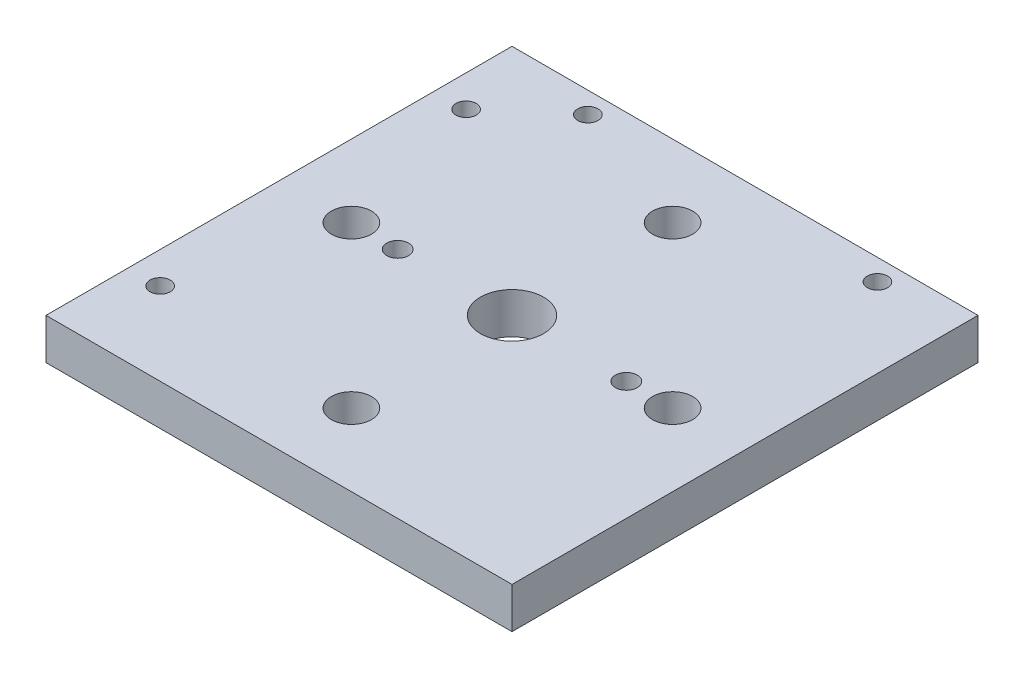
ISO-10303-21;
HEADER;
FILE_DESCRIPTION(('STEP AP214'),'2;1');
FILE_NAME('part.step','',(''),(''),'','','');
FILE_SCHEMA(('AUTOMOTIVE_DESIGN { 1 0 10303 214 1 1 1 1 }'));
ENDSEC;
DATA;
#1=APPLICATION_CONTEXT('core data for automotive mechanical design processes');
#2=APPLICATION_PROTOCOL_DEFINITION('international standard','automotive_design',2000,#1);
#3=PRODUCT_CONTEXT('',#1,'mechanical');
#4=PRODUCT('Part','Part','',(#3));
#5=PRODUCT_RELATED_PRODUCT_CATEGORY('part','',(#4));
#6=PRODUCT_DEFINITION_FORMATION('','',#4);
#7=PRODUCT_DEFINITION_CONTEXT('part definition',#1,'design');
#8=PRODUCT_DEFINITION('design','',#6,#7);
#9=PRODUCT_DEFINITION_SHAPE('','',#8);
#10=(LENGTH_UNIT() NAMED_UNIT(*) SI_UNIT(.MILLI.,.METRE.));
#11=(NAMED_UNIT(*) PLANE_ANGLE_UNIT() SI_UNIT($,.RADIAN.));
#12=(NAMED_UNIT(*) SI_UNIT($,.STERADIAN.) SOLID_ANGLE_UNIT());
#13=UNCERTAINTY_MEASURE_WITH_UNIT(LENGTH_MEASURE(1.E-05),#10,'distance_accuracy_value','');
#14=(GEOMETRIC_REPRESENTATION_CONTEXT(3) GLOBAL_UNCERTAINTY_ASSIGNED_CONTEXT((#13)) GLOBAL_UNIT_ASSIGNED_CONTEXT((#10,
#11,#12)) REPRESENTATION_CONTEXT('',''));
#15=CARTESIAN_POINT('',(0.,0.,0.));
#16=DIRECTION('',(0.,0.,1.));
#17=DIRECTION('',(1.,0.,0.));
#18=AXIS2_PLACEMENT_3D('',#15,#16,#17);
#19=CARTESIAN_POINT('',(0.,6.477,0.));
#20=DIRECTION('',(0.,1.,0.));
#21=DIRECTION('',(0.,0.,1.));
#22=AXIS2_PLACEMENT_3D('',#19,#20,#21);
#23=PLANE('',#22);
#24=CARTESIAN_POINT('',(-18.08,6.477,0.));
#25=DIRECTION('',(0.,1.,0.));
#26=DIRECTION('',(0.,0.,1.));
#27=AXIS2_PLACEMENT_3D('',#24,#25,#26);
#28=CIRCLE('',#27,1.7272);
#29=CARTESIAN_POINT('',(-18.08,6.477,1.7272));
#30=VERTEX_POINT('',#29);
#31=EDGE_CURVE('E178',#30,#30,#28,.T.);
#32=ORIENTED_EDGE('',*,*,#31,.F.);
#33=EDGE_LOOP('',(#32));
#34=FACE_BOUND('',#33,.T.);
#35=CARTESIAN_POINT('',(18.08,6.477,0.));
#36=DIRECTION('',(0.,1.,0.));
#37=DIRECTION('',(0.,0.,1.));
#38=AXIS2_PLACEMENT_3D('',#35,#36,#37);
#39=CIRCLE('',#38,1.7272);
#40=CARTESIAN_POINT('',(18.08,6.477,1.7272));
#41=VERTEX_POINT('',#40);
#42=EDGE_CURVE('E172',#41,#41,#39,.T.);
#43=ORIENTED_EDGE('',*,*,#42,.F.);
#44=EDGE_LOOP('',(#43));
#45=FACE_BOUND('',#44,.T.);
#46=CARTESIAN_POINT('',(-31.8572925499688,6.477,-24.5971855554866));
#47=DIRECTION('',(0.,1.,0.));
#48=DIRECTION('',(0.,0.,1.));
#49=AXIS2_PLACEMENT_3D('',#46,#47,#48);
#50=CIRCLE('',#49,1.60477692632348);
#51=CARTESIAN_POINT('',(-31.8572925499688,6.477,-22.9924086291631));
#52=VERTEX_POINT('',#51);
#53=EDGE_CURVE('E155',#52,#52,#50,.T.);
#54=ORIENTED_EDGE('',*,*,#53,.F.);
#55=EDGE_LOOP('',(#54));
#56=FACE_BOUND('',#55,.T.);
#57=CARTESIAN_POINT('',(24.3098998713532,6.477,-33.4851808397397));
#58=DIRECTION('',(0.,1.,0.));
#59=DIRECTION('',(0.,0.,1.));
#60=AXIS2_PLACEMENT_3D('',#57,#58,#59);
#61=CIRCLE('',#60,1.60477692632348);
#62=CARTESIAN_POINT('',(24.3098998713532,6.477,-31.8804039134163));
#63=VERTEX_POINT('',#62);
#64=EDGE_CURVE('E143',#63,#63,#61,.T.);
#65=ORIENTED_EDGE('',*,*,#64,.F.);
#66=EDGE_LOOP('',(#65));
#67=FACE_BOUND('',#66,.T.);
#68=CARTESIAN_POINT('',(-25.4,6.477,0.));
#69=DIRECTION('',(0.,1.,0.));
#70=DIRECTION('',(0.,0.,1.));
#71=AXIS2_PLACEMENT_3D('',#68,#69,#70);
#72=CIRCLE('',#71,3.17500000000026);
#73=CARTESIAN_POINT('',(-25.4,6.477,3.17500000000027));
#74=VERTEX_POINT('',#73);
#75=EDGE_CURVE('E131',#74,#74,#72,.T.);
#76=ORIENTED_EDGE('',*,*,#75,.F.);
#77=EDGE_LOOP('',(#76));
#78=FACE_BOUND('',#77,.T.);
#79=CARTESIAN_POINT('',(25.4,6.477,0.));
#80=DIRECTION('',(0.,1.,0.));
#81=DIRECTION('',(0.,0.,1.));
#82=AXIS2_PLACEMENT_3D('',#79,#80,#81);
#83=CIRCLE('',#82,3.17500000000009);
#84=CARTESIAN_POINT('',(25.4,6.477,3.17500000000008));
#85=VERTEX_POINT('',#84);
#86=EDGE_CURVE('E119',#85,#85,#83,.T.);
#87=ORIENTED_EDGE('',*,*,#86,.F.);
#88=EDGE_LOOP('',(#87));
#89=FACE_BOUND('',#88,.T.);
#90=DIRECTION('',(0.,0.,-1.));
#91=VECTOR('',#90,1.);
#92=CARTESIAN_POINT('',(36.85,6.477,-36.85));
#93=LINE('',#92,#91);
#94=CARTESIAN_POINT('',(36.85,6.477,36.85));
#95=VERTEX_POINT('',#94);
#96=CARTESIAN_POINT('',(36.85,6.477,-36.85));
#97=VERTEX_POINT('',#96);
#98=EDGE_CURVE('E89',#95,#97,#93,.T.);
#99=ORIENTED_EDGE('',*,*,#98,.T.);
#100=DIRECTION('',(-1.,0.,0.));
#101=VECTOR('',#100,1.);
#102=CARTESIAN_POINT('',(-36.85,6.477,-36.85));
#103=LINE('',#102,#101);
#104=CARTESIAN_POINT('',(-36.85,6.477,-36.85));
#105=VERTEX_POINT('',#104);
#106=EDGE_CURVE('E84',#97,#105,#103,.T.);
#107=ORIENTED_EDGE('',*,*,#106,.T.);
#108=DIRECTION('',(0.,0.,1.));
#109=VECTOR('',#108,1.);
#110=CARTESIAN_POINT('',(-36.85,6.477,-36.85));
#111=LINE('',#110,#109);
#112=CARTESIAN_POINT('',(-36.85,6.477,36.85));
#113=VERTEX_POINT('',#112);
#114=EDGE_CURVE('E87',#105,#113,#111,.T.);
#115=ORIENTED_EDGE('',*,*,#114,.T.);
#116=DIRECTION('',(1.,0.,0.));
#117=VECTOR('',#116,1.);
#118=CARTESIAN_POINT('',(-36.85,6.477,36.85));
#119=LINE('',#118,#117);
#120=EDGE_CURVE('E54',#113,#95,#119,.T.);
#121=ORIENTED_EDGE('',*,*,#120,.T.);
#122=EDGE_LOOP('',(#99,#107,#115,#121));
#123=FACE_BOUND('',#122,.T.);
#124=CARTESIAN_POINT('',(0.,6.477,-25.4));
#125=DIRECTION('',(0.,1.,0.));
#126=DIRECTION('',(0.,0.,1.));
#127=AXIS2_PLACEMENT_3D('',#124,#125,#126);
#128=CIRCLE('',#127,3.175);
#129=CARTESIAN_POINT('',(0.,6.477,-22.225));
#130=VERTEX_POINT('',#129);
#131=EDGE_CURVE('E104',#130,#130,#128,.T.);
#132=ORIENTED_EDGE('',*,*,#131,.F.);
#133=EDGE_LOOP('',(#132));
#134=FACE_BOUND('',#133,.T.);
#135=CARTESIAN_POINT('',(0.,6.477,25.4));
#136=DIRECTION('',(0.,1.,0.));
#137=DIRECTION('',(0.,0.,1.));
#138=AXIS2_PLACEMENT_3D('',#135,#136,#137);
#139=CIRCLE('',#138,3.17500000000017);
#140=CARTESIAN_POINT('',(0.,6.477,28.5750000000002));
#141=VERTEX_POINT('',#140);
#142=EDGE_CURVE('E125',#141,#141,#139,.T.);
#143=ORIENTED_EDGE('',*,*,#142,.F.);
#144=EDGE_LOOP('',(#143));
#145=FACE_BOUND('',#144,.T.);
#146=CARTESIAN_POINT('',(0.,6.477,0.));
#147=DIRECTION('',(0.,1.,0.));
#148=DIRECTION('',(0.,0.,1.));
#149=AXIS2_PLACEMENT_3D('',#146,#147,#148);
#150=CIRCLE('',#149,5.);
#151=CARTESIAN_POINT('',(0.,6.477,5.));
#152=VERTEX_POINT('',#151);
#153=EDGE_CURVE('E137',#152,#152,#150,.T.);
#154=ORIENTED_EDGE('',*,*,#153,.F.);
#155=EDGE_LOOP('',(#154));
#156=FACE_BOUND('',#155,.T.);
#157=CARTESIAN_POINT('',(-21.4879647183401,6.477,-33.4851808397397));
#158=DIRECTION('',(0.,1.,0.));
#159=DIRECTION('',(0.,0.,1.));
#160=AXIS2_PLACEMENT_3D('',#157,#158,#159);
#161=CIRCLE('',#160,1.60477692632348);
#162=CARTESIAN_POINT('',(-21.4879647183401,6.477,-31.8804039134163));
#163=VERTEX_POINT('',#162);
#164=EDGE_CURVE('E149',#163,#163,#161,.T.);
#165=ORIENTED_EDGE('',*,*,#164,.F.);
#166=EDGE_LOOP('',(#165));
#167=FACE_BOUND('',#166,.T.);
#168=CARTESIAN_POINT('',(-31.8572925499688,6.477,23.7930109921139));
#169=DIRECTION('',(0.,1.,0.));
#170=DIRECTION('',(0.,0.,1.));
#171=AXIS2_PLACEMENT_3D('',#168,#169,#170);
#172=CIRCLE('',#171,1.60477692632348);
#173=CARTESIAN_POINT('',(-31.8572925499688,6.477,25.3977879184374));
#174=VERTEX_POINT('',#173);
#175=EDGE_CURVE('E161',#174,#174,#172,.T.);
#176=ORIENTED_EDGE('',*,*,#175,.F.);
#177=EDGE_LOOP('',(#176));
#178=FACE_BOUND('',#177,.T.);
#179=ADVANCED_FACE('F37',(#34,#45,#56,#67,#78,#89,#123,#134,#145,#156,#167,#178),#23,.T.);
#180=CARTESIAN_POINT('',(0.,0.,0.));
#181=DIRECTION('',(0.,1.,0.));
#182=DIRECTION('',(0.,0.,1.));
#183=AXIS2_PLACEMENT_3D('',#180,#181,#182);
#184=PLANE('',#183);
#185=CARTESIAN_POINT('',(-18.08,0.,0.));
#186=DIRECTION('',(0.,1.,0.));
#187=DIRECTION('',(0.,0.,1.));
#188=AXIS2_PLACEMENT_3D('',#185,#186,#187);
#189=CIRCLE('',#188,1.7272);
#190=CARTESIAN_POINT('',(-18.08,0.,1.7272));
#191=VERTEX_POINT('',#190);
#192=EDGE_CURVE('E175',#191,#191,#189,.T.);
#193=ORIENTED_EDGE('',*,*,#192,.T.);
#194=EDGE_LOOP('',(#193));
#195=FACE_BOUND('',#194,.T.);
#196=CARTESIAN_POINT('',(18.08,0.,0.));
#197=DIRECTION('',(0.,1.,0.));
#198=DIRECTION('',(0.,0.,1.));
#199=AXIS2_PLACEMENT_3D('',#196,#197,#198);
#200=CIRCLE('',#199,1.7272);
#201=CARTESIAN_POINT('',(18.08,0.,1.7272));
#202=VERTEX_POINT('',#201);
#203=EDGE_CURVE('E167',#202,#202,#200,.T.);
#204=ORIENTED_EDGE('',*,*,#203,.T.);
#205=EDGE_LOOP('',(#204));
#206=FACE_BOUND('',#205,.T.);
#207=DIRECTION('',(0.,0.,-1.));
#208=VECTOR('',#207,1.);
#209=CARTESIAN_POINT('',(36.85,0.,-36.85));
#210=LINE('',#209,#208);
#211=CARTESIAN_POINT('',(36.85,0.,36.85));
#212=VERTEX_POINT('',#211);
#213=CARTESIAN_POINT('',(36.85,0.,-36.85));
#214=VERTEX_POINT('',#213);
#215=EDGE_CURVE('E101',#212,#214,#210,.T.);
#216=ORIENTED_EDGE('',*,*,#215,.F.);
#217=DIRECTION('',(1.,0.,0.));
#218=VECTOR('',#217,1.);
#219=CARTESIAN_POINT('',(-36.85,0.,36.85));
#220=LINE('',#219,#218);
#221=CARTESIAN_POINT('',(-36.85,0.,36.85));
#222=VERTEX_POINT('',#221);
#223=EDGE_CURVE('E77',#222,#212,#220,.T.);
#224=ORIENTED_EDGE('',*,*,#223,.F.);
#225=DIRECTION('',(0.,0.,1.));
#226=VECTOR('',#225,1.);
#227=CARTESIAN_POINT('',(-36.85,0.,-36.85));
#228=LINE('',#227,#226);
#229=CARTESIAN_POINT('',(-36.85,0.,-36.85));
#230=VERTEX_POINT('',#229);
#231=EDGE_CURVE('E71',#230,#222,#228,.T.);
#232=ORIENTED_EDGE('',*,*,#231,.F.);
#233=DIRECTION('',(-1.,0.,0.));
#234=VECTOR('',#233,1.);
#235=CARTESIAN_POINT('',(-36.85,0.,-36.85));
#236=LINE('',#235,#234);
#237=EDGE_CURVE('E93',#214,#230,#236,.T.);
#238=ORIENTED_EDGE('',*,*,#237,.F.);
#239=EDGE_LOOP('',(#216,#224,#232,#238));
#240=FACE_BOUND('',#239,.T.);
#241=CARTESIAN_POINT('',(0.,0.,-25.4));
#242=DIRECTION('',(0.,1.,0.));
#243=DIRECTION('',(0.,0.,1.));
#244=AXIS2_PLACEMENT_3D('',#241,#242,#243);
#245=CIRCLE('',#244,3.175);
#246=CARTESIAN_POINT('',(0.,0.,-22.225));
#247=VERTEX_POINT('',#246);
#248=EDGE_CURVE('E116',#247,#247,#245,.T.);
#249=ORIENTED_EDGE('',*,*,#248,.T.);
#250=EDGE_LOOP('',(#249));
#251=FACE_BOUND('',#250,.T.);
#252=CARTESIAN_POINT('',(25.4,0.,0.));
#253=DIRECTION('',(0.,1.,0.));
#254=DIRECTION('',(0.,0.,1.));
#255=AXIS2_PLACEMENT_3D('',#252,#253,#254);
#256=CIRCLE('',#255,3.17500000000009);
#257=CARTESIAN_POINT('',(25.4,0.,3.17500000000008));
#258=VERTEX_POINT('',#257);
#259=EDGE_CURVE('E122',#258,#258,#256,.T.);
#260=ORIENTED_EDGE('',*,*,#259,.T.);
#261=EDGE_LOOP('',(#260));
#262=FACE_BOUND('',#261,.T.);
#263=CARTESIAN_POINT('',(0.,0.,25.4));
#264=DIRECTION('',(0.,1.,0.));
#265=DIRECTION('',(0.,0.,1.));
#266=AXIS2_PLACEMENT_3D('',#263,#264,#265);
#267=CIRCLE('',#266,3.17500000000017);
#268=CARTESIAN_POINT('',(0.,0.,28.5750000000002));
#269=VERTEX_POINT('',#268);
#270=EDGE_CURVE('E128',#269,#269,#267,.T.);
#271=ORIENTED_EDGE('',*,*,#270,.T.);
#272=EDGE_LOOP('',(#271));
#273=FACE_BOUND('',#272,.T.);
#274=CARTESIAN_POINT('',(-25.4,0.,0.));
#275=DIRECTION('',(0.,1.,0.));
#276=DIRECTION('',(0.,0.,1.));
#277=AXIS2_PLACEMENT_3D('',#274,#275,#276);
#278=CIRCLE('',#277,3.17500000000026);
#279=CARTESIAN_POINT('',(-25.4,0.,3.17500000000027));
#280=VERTEX_POINT('',#279);
#281=EDGE_CURVE('E134',#280,#280,#278,.T.);
#282=ORIENTED_EDGE('',*,*,#281,.T.);
#283=EDGE_LOOP('',(#282));
#284=FACE_BOUND('',#283,.T.);
#285=CARTESIAN_POINT('',(0.,0.,0.));
#286=DIRECTION('',(0.,1.,0.));
#287=DIRECTION('',(0.,0.,1.));
#288=AXIS2_PLACEMENT_3D('',#285,#286,#287);
#289=CIRCLE('',#288,5.);
#290=CARTESIAN_POINT('',(0.,0.,5.));
#291=VERTEX_POINT('',#290);
#292=EDGE_CURVE('E140',#291,#291,#289,.T.);
#293=ORIENTED_EDGE('',*,*,#292,.T.);
#294=EDGE_LOOP('',(#293));
#295=FACE_BOUND('',#294,.T.);
#296=CARTESIAN_POINT('',(24.3098998713532,0.,-33.4851808397397));
#297=DIRECTION('',(0.,1.,0.));
#298=DIRECTION('',(0.,0.,1.));
#299=AXIS2_PLACEMENT_3D('',#296,#297,#298);
#300=CIRCLE('',#299,1.60477692632348);
#301=CARTESIAN_POINT('',(24.3098998713532,0.,-31.8804039134163));
#302=VERTEX_POINT('',#301);
#303=EDGE_CURVE('E146',#302,#302,#300,.T.);
#304=ORIENTED_EDGE('',*,*,#303,.T.);
#305=EDGE_LOOP('',(#304));
#306=FACE_BOUND('',#305,.T.);
#307=CARTESIAN_POINT('',(-21.4879647183401,0.,-33.4851808397397));
#308=DIRECTION('',(0.,1.,0.));
#309=DIRECTION('',(0.,0.,1.));
#310=AXIS2_PLACEMENT_3D('',#307,#308,#309);
#311=CIRCLE('',#310,1.60477692632348);
#312=CARTESIAN_POINT('',(-21.4879647183401,0.,-31.8804039134163));
#313=VERTEX_POINT('',#312);
#314=EDGE_CURVE('E152',#313,#313,#311,.T.);
#315=ORIENTED_EDGE('',*,*,#314,.T.);
#316=EDGE_LOOP('',(#315));
#317=FACE_BOUND('',#316,.T.);
#318=CARTESIAN_POINT('',(-31.8572925499688,0.,-24.5971855554866));
#319=DIRECTION('',(0.,1.,0.));
#320=DIRECTION('',(0.,0.,1.));
#321=AXIS2_PLACEMENT_3D('',#318,#319,#320);
#322=CIRCLE('',#321,1.60477692632348);
#323=CARTESIAN_POINT('',(-31.8572925499688,0.,-22.9924086291631));
#324=VERTEX_POINT('',#323);
#325=EDGE_CURVE('E158',#324,#324,#322,.T.);
#326=ORIENTED_EDGE('',*,*,#325,.T.);
#327=EDGE_LOOP('',(#326));
#328=FACE_BOUND('',#327,.T.);
#329=CARTESIAN_POINT('',(-31.8572925499688,0.,23.7930109921139));
#330=DIRECTION('',(0.,1.,0.));
#331=DIRECTION('',(0.,0.,1.));
#332=AXIS2_PLACEMENT_3D('',#329,#330,#331);
#333=CIRCLE('',#332,1.60477692632348);
#334=CARTESIAN_POINT('',(-31.8572925499688,0.,25.3977879184374));
#335=VERTEX_POINT('',#334);
#336=EDGE_CURVE('E164',#335,#335,#333,.T.);
#337=ORIENTED_EDGE('',*,*,#336,.T.);
#338=EDGE_LOOP('',(#337));
#339=FACE_BOUND('',#338,.T.);
#340=ADVANCED_FACE('F112',(#195,#206,#240,#251,#262,#273,#284,#295,#306,#317,#328,#339),#184,.F.);
#341=CARTESIAN_POINT('',(36.85,6.477,-36.85));
#342=DIRECTION('',(-1.,0.,0.));
#343=DIRECTION('',(0.,0.,1.));
#344=AXIS2_PLACEMENT_3D('',#341,#342,#343);
#345=PLANE('',#344);
#346=ORIENTED_EDGE('',*,*,#215,.T.);
#347=DIRECTION('',(0.,-1.,0.));
#348=VECTOR('',#347,1.);
#349=CARTESIAN_POINT('',(36.85,6.477,-36.85));
#350=LINE('',#349,#348);
#351=EDGE_CURVE('E11',#97,#214,#350,.T.);
#352=ORIENTED_EDGE('',*,*,#351,.F.);
#353=ORIENTED_EDGE('',*,*,#98,.F.);
#354=DIRECTION('',(0.,-1.,0.));
#355=VECTOR('',#354,1.);
#356=CARTESIAN_POINT('',(36.85,6.477,36.85));
#357=LINE('',#356,#355);
#358=EDGE_CURVE('E97',#95,#212,#357,.T.);
#359=ORIENTED_EDGE('',*,*,#358,.T.);
#360=EDGE_LOOP('',(#346,#352,#353,#359));
#361=FACE_BOUND('',#360,.T.);
#362=ADVANCED_FACE('F39',(#361),#345,.F.);
#363=CARTESIAN_POINT('',(-36.85,6.477,-36.85));
#364=DIRECTION('',(0.,0.,1.));
#365=DIRECTION('',(1.,0.,0.));
#366=AXIS2_PLACEMENT_3D('',#363,#364,#365);
#367=PLANE('',#366);
#368=ORIENTED_EDGE('',*,*,#237,.T.);
#369=DIRECTION('',(0.,-1.,0.));
#370=VECTOR('',#369,1.);
#371=CARTESIAN_POINT('',(-36.85,6.477,-36.85));
#372=LINE('',#371,#370);
#373=EDGE_CURVE('E46',#105,#230,#372,.T.);
#374=ORIENTED_EDGE('',*,*,#373,.F.);
#375=ORIENTED_EDGE('',*,*,#106,.F.);
#376=ORIENTED_EDGE('',*,*,#351,.T.);
#377=EDGE_LOOP('',(#368,#374,#375,#376));
#378=FACE_BOUND('',#377,.T.);
#379=ADVANCED_FACE('F92',(#378),#367,.F.);
#380=CARTESIAN_POINT('',(-36.85,6.477,-36.85));
#381=DIRECTION('',(1.,0.,0.));
#382=DIRECTION('',(0.,0.,-1.));
#383=AXIS2_PLACEMENT_3D('',#380,#381,#382);
#384=PLANE('',#383);
#385=ORIENTED_EDGE('',*,*,#231,.T.);
#386=DIRECTION('',(0.,-1.,0.));
#387=VECTOR('',#386,1.);
#388=CARTESIAN_POINT('',(-36.85,6.477,36.85));
#389=LINE('',#388,#387);
#390=EDGE_CURVE('E94',#113,#222,#389,.T.);
#391=ORIENTED_EDGE('',*,*,#390,.F.);
#392=ORIENTED_EDGE('',*,*,#114,.F.);
#393=ORIENTED_EDGE('',*,*,#373,.T.);
#394=EDGE_LOOP('',(#385,#391,#392,#393));
#395=FACE_BOUND('',#394,.T.);
#396=ADVANCED_FACE('F95',(#395),#384,.F.);
#397=CARTESIAN_POINT('',(-36.85,6.477,36.85));
#398=DIRECTION('',(0.,0.,-1.));
#399=DIRECTION('',(-1.,0.,0.));
#400=AXIS2_PLACEMENT_3D('',#397,#398,#399);
#401=PLANE('',#400);
#402=ORIENTED_EDGE('',*,*,#223,.T.);
#403=ORIENTED_EDGE('',*,*,#358,.F.);
#404=ORIENTED_EDGE('',*,*,#120,.F.);
#405=ORIENTED_EDGE('',*,*,#390,.T.);
#406=EDGE_LOOP('',(#402,#403,#404,#405));
#407=FACE_BOUND('',#406,.T.);
#408=ADVANCED_FACE('F109',(#407),#401,.F.);
#409=CARTESIAN_POINT('',(0.,6.477,-25.4));
#410=DIRECTION('',(0.,-1.,0.));
#411=DIRECTION('',(0.,0.,-1.));
#412=AXIS2_PLACEMENT_3D('',#409,#410,#411);
#413=CYLINDRICAL_SURFACE('',#412,3.175);
#414=ORIENTED_EDGE('',*,*,#131,.T.);
#415=EDGE_LOOP('',(#414));
#416=FACE_BOUND('',#415,.T.);
#417=ORIENTED_EDGE('',*,*,#248,.F.);
#418=EDGE_LOOP('',(#417));
#419=FACE_BOUND('',#418,.T.);
#420=ADVANCED_FACE('F201',(#416,#419),#413,.F.);
#421=CARTESIAN_POINT('',(25.4,6.477,0.));
#422=DIRECTION('',(0.,-1.,0.));
#423=DIRECTION('',(0.,0.,-1.));
#424=AXIS2_PLACEMENT_3D('',#421,#422,#423);
#425=CYLINDRICAL_SURFACE('',#424,3.17500000000009);
#426=ORIENTED_EDGE('',*,*,#86,.T.);
#427=EDGE_LOOP('',(#426));
#428=FACE_BOUND('',#427,.T.);
#429=ORIENTED_EDGE('',*,*,#259,.F.);
#430=EDGE_LOOP('',(#429));
#431=FACE_BOUND('',#430,.T.);
#432=ADVANCED_FACE('F197',(#428,#431),#425,.F.);
#433=CARTESIAN_POINT('',(0.,6.477,25.4));
#434=DIRECTION('',(0.,-1.,0.));
#435=DIRECTION('',(0.,0.,-1.));
#436=AXIS2_PLACEMENT_3D('',#433,#434,#435);
#437=CYLINDRICAL_SURFACE('',#436,3.17500000000017);
#438=ORIENTED_EDGE('',*,*,#142,.T.);
#439=EDGE_LOOP('',(#438));
#440=FACE_BOUND('',#439,.T.);
#441=ORIENTED_EDGE('',*,*,#270,.F.);
#442=EDGE_LOOP('',(#441));
#443=FACE_BOUND('',#442,.T.);
#444=ADVANCED_FACE('F200',(#440,#443),#437,.F.);
#445=CARTESIAN_POINT('',(-25.4,6.477,0.));
#446=DIRECTION('',(0.,-1.,0.));
#447=DIRECTION('',(0.,0.,-1.));
#448=AXIS2_PLACEMENT_3D('',#445,#446,#447);
#449=CYLINDRICAL_SURFACE('',#448,3.17500000000026);
#450=ORIENTED_EDGE('',*,*,#75,.T.);
#451=EDGE_LOOP('',(#450));
#452=FACE_BOUND('',#451,.T.);
#453=ORIENTED_EDGE('',*,*,#281,.F.);
#454=EDGE_LOOP('',(#453));
#455=FACE_BOUND('',#454,.T.);
#456=ADVANCED_FACE('F250',(#452,#455),#449,.F.);
#457=CARTESIAN_POINT('',(0.,6.477,0.));
#458=DIRECTION('',(0.,-1.,0.));
#459=DIRECTION('',(0.,0.,-1.));
#460=AXIS2_PLACEMENT_3D('',#457,#458,#459);
#461=CYLINDRICAL_SURFACE('',#460,5.);
#462=ORIENTED_EDGE('',*,*,#153,.T.);
#463=EDGE_LOOP('',(#462));
#464=FACE_BOUND('',#463,.T.);
#465=ORIENTED_EDGE('',*,*,#292,.F.);
#466=EDGE_LOOP('',(#465));
#467=FACE_BOUND('',#466,.T.);
#468=ADVANCED_FACE('F246',(#464,#467),#461,.F.);
#469=CARTESIAN_POINT('',(24.3098998713532,6.477,-33.4851808397397));
#470=DIRECTION('',(0.,-1.,0.));
#471=DIRECTION('',(0.,0.,-1.));
#472=AXIS2_PLACEMENT_3D('',#469,#470,#471);
#473=CYLINDRICAL_SURFACE('',#472,1.60477692632348);
#474=ORIENTED_EDGE('',*,*,#64,.T.);
#475=EDGE_LOOP('',(#474));
#476=FACE_BOUND('',#475,.T.);
#477=ORIENTED_EDGE('',*,*,#303,.F.);
#478=EDGE_LOOP('',(#477));
#479=FACE_BOUND('',#478,.T.);
#480=ADVANCED_FACE('F242',(#476,#479),#473,.F.);
#481=CARTESIAN_POINT('',(-21.4879647183401,6.477,-33.4851808397397));
#482=DIRECTION('',(0.,-1.,0.));
#483=DIRECTION('',(0.,0.,-1.));
#484=AXIS2_PLACEMENT_3D('',#481,#482,#483);
#485=CYLINDRICAL_SURFACE('',#484,1.60477692632348);
#486=ORIENTED_EDGE('',*,*,#164,.T.);
#487=EDGE_LOOP('',(#486));
#488=FACE_BOUND('',#487,.T.);
#489=ORIENTED_EDGE('',*,*,#314,.F.);
#490=EDGE_LOOP('',(#489));
#491=FACE_BOUND('',#490,.T.);
#492=ADVANCED_FACE('F235',(#488,#491),#485,.F.);
#493=CARTESIAN_POINT('',(-31.8572925499688,6.477,-24.5971855554866));
#494=DIRECTION('',(0.,-1.,0.));
#495=DIRECTION('',(0.,0.,-1.));
#496=AXIS2_PLACEMENT_3D('',#493,#494,#495);
#497=CYLINDRICAL_SURFACE('',#496,1.60477692632348);
#498=ORIENTED_EDGE('',*,*,#53,.T.);
#499=EDGE_LOOP('',(#498));
#500=FACE_BOUND('',#499,.T.);
#501=ORIENTED_EDGE('',*,*,#325,.F.);
#502=EDGE_LOOP('',(#501));
#503=FACE_BOUND('',#502,.T.);
#504=ADVANCED_FACE('F226',(#500,#503),#497,.F.);
#505=CARTESIAN_POINT('',(-31.8572925499688,6.477,23.7930109921139));
#506=DIRECTION('',(0.,-1.,0.));
#507=DIRECTION('',(0.,0.,-1.));
#508=AXIS2_PLACEMENT_3D('',#505,#506,#507);
#509=CYLINDRICAL_SURFACE('',#508,1.60477692632348);
#510=ORIENTED_EDGE('',*,*,#175,.T.);
#511=EDGE_LOOP('',(#510));
#512=FACE_BOUND('',#511,.T.);
#513=ORIENTED_EDGE('',*,*,#336,.F.);
#514=EDGE_LOOP('',(#513));
#515=FACE_BOUND('',#514,.T.);
#516=ADVANCED_FACE('F223',(#512,#515),#509,.F.);
#517=CARTESIAN_POINT('',(18.08,6.477,0.));
#518=DIRECTION('',(0.,1.,0.));
#519=DIRECTION('',(0.,0.,1.));
#520=AXIS2_PLACEMENT_3D('',#517,#518,#519);
#521=CYLINDRICAL_SURFACE('',#520,1.7272);
#522=ORIENTED_EDGE('',*,*,#203,.F.);
#523=EDGE_LOOP('',(#522));
#524=FACE_BOUND('',#523,.T.);
#525=ORIENTED_EDGE('',*,*,#42,.T.);
#526=EDGE_LOOP('',(#525));
#527=FACE_BOUND('',#526,.T.);
#528=ADVANCED_FACE('F225',(#524,#527),#521,.F.);
#529=CARTESIAN_POINT('',(-18.08,6.477,0.));
#530=DIRECTION('',(0.,1.,0.));
#531=DIRECTION('',(0.,0.,1.));
#532=AXIS2_PLACEMENT_3D('',#529,#530,#531);
#533=CYLINDRICAL_SURFACE('',#532,1.7272);
#534=ORIENTED_EDGE('',*,*,#192,.F.);
#535=EDGE_LOOP('',(#534));
#536=FACE_BOUND('',#535,.T.);
#537=ORIENTED_EDGE('',*,*,#31,.T.);
#538=EDGE_LOOP('',(#537));
#539=FACE_BOUND('',#538,.T.);
#540=ADVANCED_FACE('F182',(#536,#539),#533,.F.);
#541=CLOSED_SHELL('',(#179,#340,#362,#379,#396,#408,#420,#432,#444,#456,#468,#480,#492,#504,
#516,#528,#540));
#542=MANIFOLD_SOLID_BREP('B2',#541);
#543=ADVANCED_BREP_SHAPE_REPRESENTATION('',(#18,#542),#14);
#544=SHAPE_DEFINITION_REPRESENTATION(#9,#543);
ENDSEC;
END-ISO-10303-21;
